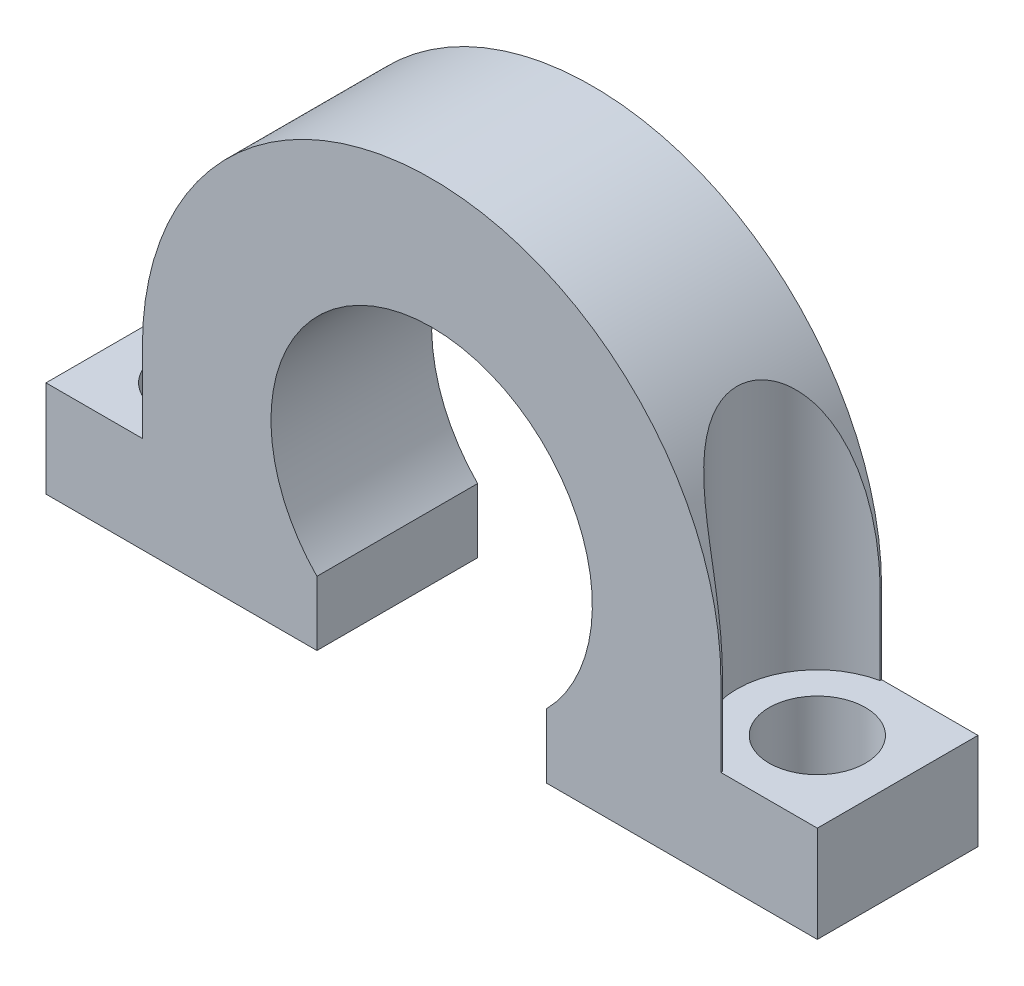
ISO-10303-21;
HEADER;
FILE_DESCRIPTION(('STEP AP214'),'2;1');
FILE_NAME('part.step','',(''),(''),'','','');
FILE_SCHEMA(('AUTOMOTIVE_DESIGN { 1 0 10303 214 1 1 1 1 }'));
ENDSEC;
DATA;
#1=APPLICATION_CONTEXT('core data for automotive mechanical design processes');
#2=APPLICATION_PROTOCOL_DEFINITION('international standard','automotive_design',2000,#1);
#3=PRODUCT_CONTEXT('',#1,'mechanical');
#4=PRODUCT('Part','Part','',(#3));
#5=PRODUCT_RELATED_PRODUCT_CATEGORY('part','',(#4));
#6=PRODUCT_DEFINITION_FORMATION('','',#4);
#7=PRODUCT_DEFINITION_CONTEXT('part definition',#1,'design');
#8=PRODUCT_DEFINITION('design','',#6,#7);
#9=PRODUCT_DEFINITION_SHAPE('','',#8);
#10=(LENGTH_UNIT() NAMED_UNIT(*) SI_UNIT(.MILLI.,.METRE.));
#11=(NAMED_UNIT(*) PLANE_ANGLE_UNIT() SI_UNIT($,.RADIAN.));
#12=(NAMED_UNIT(*) SI_UNIT($,.STERADIAN.) SOLID_ANGLE_UNIT());
#13=UNCERTAINTY_MEASURE_WITH_UNIT(LENGTH_MEASURE(1.E-05),#10,'distance_accuracy_value','');
#14=(GEOMETRIC_REPRESENTATION_CONTEXT(3) GLOBAL_UNCERTAINTY_ASSIGNED_CONTEXT((#13)) GLOBAL_UNIT_ASSIGNED_CONTEXT((#10,
#11,#12)) REPRESENTATION_CONTEXT('',''));
#15=CARTESIAN_POINT('',(0.,0.,0.));
#16=DIRECTION('',(0.,0.,1.));
#17=DIRECTION('',(1.,0.,0.));
#18=AXIS2_PLACEMENT_3D('',#15,#16,#17);
#19=CARTESIAN_POINT('',(9.,0.,5.));
#20=DIRECTION('',(1.,0.,0.));
#21=DIRECTION('',(0.,0.,-1.));
#22=AXIS2_PLACEMENT_3D('',#19,#20,#21);
#23=PLANE('',#22);
#24=DIRECTION('',(0.,0.,-1.));
#25=VECTOR('',#24,1.);
#26=CARTESIAN_POINT('',(9.,0.,5.));
#27=LINE('',#26,#25);
#28=CARTESIAN_POINT('',(9.,0.,0.0505102572168213));
#29=VERTEX_POINT('',#28);
#30=CARTESIAN_POINT('',(9.,0.,0.));
#31=VERTEX_POINT('',#30);
#32=EDGE_CURVE('E151',#29,#31,#27,.T.);
#33=ORIENTED_EDGE('',*,*,#32,.F.);
#34=DIRECTION('',(0.,-1.,0.));
#35=VECTOR('',#34,1.);
#36=CARTESIAN_POINT('',(9.,9.,0.0505102572168213));
#37=LINE('',#36,#35);
#38=CARTESIAN_POINT('',(9.,-2.5,0.0505102572168213));
#39=VERTEX_POINT('',#38);
#40=EDGE_CURVE('E473',#29,#39,#37,.T.);
#41=ORIENTED_EDGE('',*,*,#40,.T.);
#42=DIRECTION('',(0.,0.,-1.));
#43=VECTOR('',#42,1.);
#44=CARTESIAN_POINT('',(9.,-2.5,5.));
#45=LINE('',#44,#43);
#46=CARTESIAN_POINT('',(9.,-2.5,0.));
#47=VERTEX_POINT('',#46);
#48=EDGE_CURVE('E150',#39,#47,#45,.T.);
#49=ORIENTED_EDGE('',*,*,#48,.T.);
#50=DIRECTION('',(0.,-1.,0.));
#51=VECTOR('',#50,1.);
#52=CARTESIAN_POINT('',(9.,0.,0.));
#53=LINE('',#52,#51);
#54=EDGE_CURVE('E195',#31,#47,#53,.T.);
#55=ORIENTED_EDGE('',*,*,#54,.F.);
#56=EDGE_LOOP('',(#33,#41,#49,#55));
#57=FACE_BOUND('',#56,.T.);
#58=ADVANCED_FACE('F32',(#57),#23,.T.);
#59=CARTESIAN_POINT('',(-9.,-2.5,5.));
#60=DIRECTION('',(-1.,0.,0.));
#61=DIRECTION('',(0.,0.,1.));
#62=AXIS2_PLACEMENT_3D('',#59,#60,#61);
#63=PLANE('',#62);
#64=DIRECTION('',(0.,0.,-1.));
#65=VECTOR('',#64,1.);
#66=CARTESIAN_POINT('',(-9.,0.,5.));
#67=LINE('',#66,#65);
#68=CARTESIAN_POINT('',(-9.,0.,5.));
#69=VERTEX_POINT('',#68);
#70=CARTESIAN_POINT('',(-9.,0.,4.94948974278318));
#71=VERTEX_POINT('',#70);
#72=EDGE_CURVE('E163',#69,#71,#67,.T.);
#73=ORIENTED_EDGE('',*,*,#72,.T.);
#74=DIRECTION('',(0.,-1.,0.));
#75=VECTOR('',#74,1.);
#76=CARTESIAN_POINT('',(-9.,9.,4.94948974278318));
#77=LINE('',#76,#75);
#78=CARTESIAN_POINT('',(-9.,-2.5,4.94948974278318));
#79=VERTEX_POINT('',#78);
#80=EDGE_CURVE('E254',#71,#79,#77,.T.);
#81=ORIENTED_EDGE('',*,*,#80,.T.);
#82=DIRECTION('',(0.,0.,-1.));
#83=VECTOR('',#82,1.);
#84=CARTESIAN_POINT('',(-9.,-2.5,5.));
#85=LINE('',#84,#83);
#86=CARTESIAN_POINT('',(-9.,-2.5,5.));
#87=VERTEX_POINT('',#86);
#88=EDGE_CURVE('E49',#87,#79,#85,.T.);
#89=ORIENTED_EDGE('',*,*,#88,.F.);
#90=DIRECTION('',(0.,1.,0.));
#91=VECTOR('',#90,1.);
#92=CARTESIAN_POINT('',(-9.,-2.5,5.));
#93=LINE('',#92,#91);
#94=EDGE_CURVE('E164',#87,#69,#93,.T.);
#95=ORIENTED_EDGE('',*,*,#94,.T.);
#96=EDGE_LOOP('',(#73,#81,#89,#95));
#97=FACE_BOUND('',#96,.T.);
#98=ADVANCED_FACE('F260',(#97),#63,.T.);
#99=CARTESIAN_POINT('',(9.,-2.5,5.));
#100=VERTEX_POINT('',#99);
#101=CARTESIAN_POINT('',(9.,-2.5,4.94948974278318));
#102=VERTEX_POINT('',#101);
#103=EDGE_CURVE('E206',#100,#102,#45,.T.);
#104=ORIENTED_EDGE('',*,*,#103,.T.);
#105=DIRECTION('',(0.,-1.,0.));
#106=VECTOR('',#105,1.);
#107=CARTESIAN_POINT('',(9.,9.,4.94948974278318));
#108=LINE('',#107,#106);
#109=CARTESIAN_POINT('',(9.,0.,4.94948974278318));
#110=VERTEX_POINT('',#109);
#111=EDGE_CURVE('E146',#102,#110,#108,.F.);
#112=ORIENTED_EDGE('',*,*,#111,.T.);
#113=CARTESIAN_POINT('',(9.,0.,5.));
#114=VERTEX_POINT('',#113);
#115=EDGE_CURVE('E139',#114,#110,#27,.T.);
#116=ORIENTED_EDGE('',*,*,#115,.F.);
#117=DIRECTION('',(0.,-1.,0.));
#118=VECTOR('',#117,1.);
#119=CARTESIAN_POINT('',(9.,0.,5.));
#120=LINE('',#119,#118);
#121=EDGE_CURVE('E143',#114,#100,#120,.T.);
#122=ORIENTED_EDGE('',*,*,#121,.T.);
#123=EDGE_LOOP('',(#104,#112,#116,#122));
#124=FACE_BOUND('',#123,.T.);
#125=ADVANCED_FACE('F142',(#124),#23,.T.);
#126=CARTESIAN_POINT('',(0.,0.,5.));
#127=DIRECTION('',(0.,0.,-1.));
#128=DIRECTION('',(-1.,0.,0.));
#129=AXIS2_PLACEMENT_3D('',#126,#127,#128);
#130=CYLINDRICAL_SURFACE('',#129,9.);
#131=CARTESIAN_POINT('',(-9.,0.,0.0505102572168209));
#132=VERTEX_POINT('',#131);
#133=CARTESIAN_POINT('',(-9.,0.,0.));
#134=VERTEX_POINT('',#133);
#135=EDGE_CURVE('E91',#132,#134,#67,.T.);
#136=ORIENTED_EDGE('',*,*,#135,.F.);
#137=CARTESIAN_POINT('',(-9.,0.,0.0505102572168209));
#138=CARTESIAN_POINT('',(-9.00000087562687,0.10518954389977,0.0505192598018908));
#139=CARTESIAN_POINT('',(-8.99815585961762,0.2103788002763,0.0508869358986503));
#140=CARTESIAN_POINT('',(-8.9907805688804,0.420625297368176,0.0524049397413621));
#141=CARTESIAN_POINT('',(-8.98525018974616,0.52568253425893,0.0535552896604704));
#142=CARTESIAN_POINT('',(-8.97050334416002,0.735632272470598,0.056705523598621));
#143=CARTESIAN_POINT('',(-8.96128320507734,0.840524504806676,0.0587062541741343));
#144=CARTESIAN_POINT('',(-8.93917281899488,1.04989188588659,0.0636915639051354));
#145=CARTESIAN_POINT('',(-8.92628260863443,1.1543670387837,0.0666761332387354));
#146=CARTESIAN_POINT('',(-8.88189821371534,1.46862841347652,0.0774172340411788));
#147=CARTESIAN_POINT('',(-8.84480621383425,1.6775962387999,0.0869416097761807));
#148=CARTESIAN_POINT('',(-8.75607223794641,2.09189679975476,0.11280226243128));
#149=CARTESIAN_POINT('',(-8.70443865984531,2.29723156098695,0.129134610285925));
#150=CARTESIAN_POINT('',(-8.60891557883608,2.62759016544451,0.163872489447794));
#151=CARTESIAN_POINT('',(-8.56925256497087,2.75416421119305,0.179264284785005));
#152=CARTESIAN_POINT('',(-8.48460312162089,3.00482929639772,0.215030306512376));
#153=CARTESIAN_POINT('',(-8.43961655268337,3.12892027070917,0.235404663437734));
#154=CARTESIAN_POINT('',(-8.34477051120259,3.37372157523942,0.282290200496294));
#155=CARTESIAN_POINT('',(-8.29492245415785,3.49443900781135,0.30878719514737));
#156=CARTESIAN_POINT('',(-8.19078788033777,3.73199543672591,0.369367426358142));
#157=CARTESIAN_POINT('',(-8.13650280268749,3.84883567346581,0.403448209283725));
#158=CARTESIAN_POINT('',(-8.0409267817847,4.04370431569827,0.46938455082877));
#159=CARTESIAN_POINT('',(-8.00055264337671,4.12297311805137,0.49890635397994));
#160=CARTESIAN_POINT('',(-7.91841144990452,4.27860900679302,0.563173161713274));
#161=CARTESIAN_POINT('',(-7.87664478571677,4.35497689479306,0.597916710019088));
#162=CARTESIAN_POINT('',(-7.79228527909037,4.50417829306891,0.673280118496684));
#163=CARTESIAN_POINT('',(-7.74969339235354,4.57701558543396,0.713893496238789));
#164=CARTESIAN_POINT('',(-7.66437654390341,4.71849128592082,0.801697575439036));
#165=CARTESIAN_POINT('',(-7.62165164650168,4.78713146691606,0.848885471795271));
#166=CARTESIAN_POINT('',(-7.52144632363581,4.94361287731968,0.969150151078017));
#167=CARTESIAN_POINT('',(-7.4642860938569,5.02929169505435,1.04538249314183));
#168=CARTESIAN_POINT('',(-7.35461505487417,5.18834838258779,1.21264513363957));
#169=CARTESIAN_POINT('',(-7.30209816975124,5.26174244310554,1.30365563828947));
#170=CARTESIAN_POINT('',(-7.2153523993646,5.37986792487318,1.48111972038228));
#171=CARTESIAN_POINT('',(-7.17955965092524,5.42739745061617,1.56492934033137));
#172=CARTESIAN_POINT('',(-7.11608756605497,5.51035691872144,1.74123922984381));
#173=CARTESIAN_POINT('',(-7.08840440367026,5.5457925680591,1.83373537397607));
#174=CARTESIAN_POINT('',(-7.0433260406144,5.60293807944634,2.02611031027793));
#175=CARTESIAN_POINT('',(-7.02600752858423,5.62454570663911,2.12603812943071));
#176=CARTESIAN_POINT('',(-7.00373911506158,5.65225388772259,2.32936881008092));
#177=CARTESIAN_POINT('',(-6.99878181455195,5.65836371812565,2.4327695552121));
#178=CARTESIAN_POINT('',(-7.00155445293326,5.65492889108807,2.62650331602725));
#179=CARTESIAN_POINT('',(-7.00781632421854,5.64719574924814,2.71689789680465));
#180=CARTESIAN_POINT('',(-7.02972751609976,5.61989628784571,2.89468109567283));
#181=CARTESIAN_POINT('',(-7.04537587780184,5.60033117699767,2.98207001984781));
#182=CARTESIAN_POINT('',(-7.084816743789,5.55034846782082,3.15149783858141));
#183=CARTESIAN_POINT('',(-7.10859280610232,5.51995277405638,3.23354713913587));
#184=CARTESIAN_POINT('',(-7.16270193033711,5.44955708525262,3.39105944179871));
#185=CARTESIAN_POINT('',(-7.19303792970967,5.40955278671844,3.46651947200145));
#186=CARTESIAN_POINT('',(-7.27293781874538,5.3019408536592,3.64151559300579));
#187=CARTESIAN_POINT('',(-7.32510817548217,5.22991305873915,3.73714582631619));
#188=CARTESIAN_POINT('',(-7.43499020111441,5.0724893768648,3.91299274755286));
#189=CARTESIAN_POINT('',(-7.4927129528506,4.98706652936295,3.99317760669587));
#190=CARTESIAN_POINT('',(-7.5947807010306,4.82966909180307,4.12016365338923));
#191=CARTESIAN_POINT('',(-7.63869695072026,4.75998166821211,4.17022164400622));
#192=CARTESIAN_POINT('',(-7.72655817707644,4.61599480639774,4.26323575589728));
#193=CARTESIAN_POINT('',(-7.77050315719068,4.54169309874862,4.30618834388651));
#194=CARTESIAN_POINT('',(-7.85763291038962,4.3892286384456,4.38576691443791));
#195=CARTESIAN_POINT('',(-7.90081661992494,4.31106098775352,4.42238459236354));
#196=CARTESIAN_POINT('',(-7.98577539744816,4.15157418590454,4.48999201672684));
#197=CARTESIAN_POINT('',(-8.02754993964106,4.07025388221604,4.52097968097597));
#198=CARTESIAN_POINT('',(-8.13733022329687,3.84811928703314,4.59767174470065));
#199=CARTESIAN_POINT('',(-8.20360594090217,3.70487124422167,4.63883043093934));
#200=CARTESIAN_POINT('',(-8.32937280235805,3.41275574503438,4.7101701562913));
#201=CARTESIAN_POINT('',(-8.38885910559575,3.26388437883749,4.74034339632088));
#202=CARTESIAN_POINT('',(-8.50036251105949,2.96140223738335,4.79227335786243));
#203=CARTESIAN_POINT('',(-8.55235472338514,2.8077776378995,4.81400242159528));
#204=CARTESIAN_POINT('',(-8.64813903363084,2.49722137448821,4.8509495910058));
#205=CARTESIAN_POINT('',(-8.69192952400983,2.34028906894084,4.86616642103229));
#206=CARTESIAN_POINT('',(-8.77611054638887,2.00344432704932,4.89336389718386));
#207=CARTESIAN_POINT('',(-8.81532880804,1.82318488248432,4.90467143695235));
#208=CARTESIAN_POINT('',(-8.88264628677153,1.46036160720787,4.92282596299743));
#209=CARTESIAN_POINT('',(-8.9107432454381,1.27779731620815,4.92967204346341));
#210=CARTESIAN_POINT('',(-8.9554388182679,0.912988359853412,4.94007711850932));
#211=CARTESIAN_POINT('',(-8.97214774262027,0.730758192501817,4.94366776258925));
#212=CARTESIAN_POINT('',(-8.98885772942567,0.456945872457939,4.94719446151849));
#213=CARTESIAN_POINT('',(-8.99303549117236,0.365611480468681,4.94806015980659));
#214=CARTESIAN_POINT('',(-8.99860663114833,0.182853415689014,4.94920585201511));
#215=CARTESIAN_POINT('',(-8.99999998825157,0.0914297422264674,4.94948584149158));
#216=CARTESIAN_POINT('',(-9.,0.,4.94948974278323));
#217=B_SPLINE_CURVE_WITH_KNOTS('',3,(#137,#138,#139,#140,#141,#142,#143,#144,#145,#146,#147,
#148,#149,#150,#151,#152,#153,#154,#155,#156,#157,#158,#159,#160,#161,#162,#163,#164,#165,#166,
#167,#168,#169,#170,#171,#172,#173,#174,#175,#176,#177,#178,#179,#180,#181,#182,#183,#184,#185,
#186,#187,#188,#189,#190,#191,#192,#193,#194,#195,#196,#197,#198,#199,#200,#201,#202,#203,#204,
#205,#206,#207,#208,#209,#210,#211,#212,#213,#214,#215,#216),.UNSPECIFIED.,.F.,.F.,(4,2,2,2,2,2,
2,2,2,2,2,2,2,2,2,2,2,2,2,2,2,2,2,2,2,2,2,2,2,2,2,2,2,2,2,2,2,2,2,4),(0.,0.31555109411797,
0.63111112817335,0.946986041677593,1.26285780182566,1.89956471671294,2.53590467841028,
2.93631571568562,3.33673724421808,3.73624018063852,4.13561405062598,4.41663096127427,
4.6975696449165,4.97820040761455,5.25871180022386,5.64184725770908,6.02447371576498,
6.33160496056692,6.63859107226289,6.94782137762819,7.25686654336132,7.52836947879261,
7.79984468307422,8.07077392369024,8.34182473490995,8.73143192344412,9.12183359448996,
9.41061585324703,9.69954128511489,9.98884265479976,10.278250802061,10.7668028672774,
11.2557011052846,11.7461874331695,12.2367697962119,12.7908026103572,13.3449478748351,
13.8936460715452,14.1679099625106,14.4421759343852),.UNSPECIFIED.);
#218=EDGE_CURVE('E253',#132,#71,#217,.T.);
#219=ORIENTED_EDGE('',*,*,#218,.T.);
#220=ORIENTED_EDGE('',*,*,#72,.F.);
#221=CARTESIAN_POINT('',(0.,0.,5.));
#222=DIRECTION('',(0.,0.,-1.));
#223=DIRECTION('',(-1.,0.,0.));
#224=AXIS2_PLACEMENT_3D('',#221,#222,#223);
#225=CIRCLE('',#224,9.);
#226=EDGE_CURVE('E155',#69,#114,#225,.T.);
#227=ORIENTED_EDGE('',*,*,#226,.T.);
#228=ORIENTED_EDGE('',*,*,#115,.T.);
#229=CARTESIAN_POINT('',(9.,0.,4.94948974278318));
#230=CARTESIAN_POINT('',(9.00000087562687,0.105189543899771,4.94948074019811));
#231=CARTESIAN_POINT('',(8.99815585961762,0.210378800276302,4.94911306410135));
#232=CARTESIAN_POINT('',(8.9907805688804,0.420625297368177,4.94759506025864));
#233=CARTESIAN_POINT('',(8.98525018974616,0.525682534258931,4.94644471033953));
#234=CARTESIAN_POINT('',(8.97050334416002,0.735632272470599,4.94329447640138));
#235=CARTESIAN_POINT('',(8.96128320507734,0.840524504806677,4.94129374582587));
#236=CARTESIAN_POINT('',(8.93917281899488,1.0498918858866,4.93630843609486));
#237=CARTESIAN_POINT('',(8.92628260863443,1.1543670387837,4.93332386676126));
#238=CARTESIAN_POINT('',(8.88189821371534,1.46862841347652,4.92258276595882));
#239=CARTESIAN_POINT('',(8.84480621383425,1.6775962387999,4.91305839022382));
#240=CARTESIAN_POINT('',(8.75607223794642,2.09189679975476,4.88719773756872));
#241=CARTESIAN_POINT('',(8.70443865984531,2.29723156098695,4.87086538971407));
#242=CARTESIAN_POINT('',(8.60891557883608,2.62759016544451,4.83612751055221));
#243=CARTESIAN_POINT('',(8.56925256497087,2.75416421119305,4.82073571521499));
#244=CARTESIAN_POINT('',(8.48460312162089,3.00482929639772,4.78496969348762));
#245=CARTESIAN_POINT('',(8.43961655268337,3.12892027070917,4.76459533656227));
#246=CARTESIAN_POINT('',(8.34477051120259,3.37372157523942,4.71770979950371));
#247=CARTESIAN_POINT('',(8.29492245415785,3.49443900781135,4.69121280485263));
#248=CARTESIAN_POINT('',(8.19078788033777,3.73199543672591,4.63063257364186));
#249=CARTESIAN_POINT('',(8.13650280268749,3.84883567346581,4.59655179071628));
#250=CARTESIAN_POINT('',(8.04092678178471,4.04370431569826,4.53061544917123));
#251=CARTESIAN_POINT('',(8.00055264337671,4.12297311805137,4.50109364602006));
#252=CARTESIAN_POINT('',(7.91841144990452,4.27860900679302,4.43682683828673));
#253=CARTESIAN_POINT('',(7.87664478571678,4.35497689479305,4.40208328998091));
#254=CARTESIAN_POINT('',(7.79228527909037,4.50417829306891,4.32671988150332));
#255=CARTESIAN_POINT('',(7.74969339235354,4.57701558543396,4.28610650376121));
#256=CARTESIAN_POINT('',(7.66437654390341,4.71849128592082,4.19830242456097));
#257=CARTESIAN_POINT('',(7.62165164650168,4.78713146691605,4.15111452820473));
#258=CARTESIAN_POINT('',(7.52144632363581,4.94361287731968,4.03084984892198));
#259=CARTESIAN_POINT('',(7.46428609385691,5.02929169505434,3.95461750685817));
#260=CARTESIAN_POINT('',(7.35461505487417,5.18834838258779,3.78735486636044));
#261=CARTESIAN_POINT('',(7.30209816975124,5.26174244310553,3.69634436171053));
#262=CARTESIAN_POINT('',(7.2153523993646,5.37986792487317,3.51888027961772));
#263=CARTESIAN_POINT('',(7.17955965092524,5.42739745061617,3.43507065966863));
#264=CARTESIAN_POINT('',(7.11608756605497,5.51035691872143,3.25876077015619));
#265=CARTESIAN_POINT('',(7.08840440367026,5.54579256805909,3.16626462602393));
#266=CARTESIAN_POINT('',(7.0433260406144,5.60293807944633,2.97388968972207));
#267=CARTESIAN_POINT('',(7.02600752858423,5.62454570663911,2.87396187056928));
#268=CARTESIAN_POINT('',(7.00373911506158,5.65225388772259,2.67063118991908));
#269=CARTESIAN_POINT('',(6.99878181455196,5.65836371812565,2.5672304447879));
#270=CARTESIAN_POINT('',(7.00155445293326,5.65492889108806,2.37349668397275));
#271=CARTESIAN_POINT('',(7.00781632421854,5.64719574924814,2.28310210319535));
#272=CARTESIAN_POINT('',(7.02972751609976,5.61989628784571,2.10531890432717));
#273=CARTESIAN_POINT('',(7.04537587780184,5.60033117699767,2.01792998015219));
#274=CARTESIAN_POINT('',(7.084816743789,5.55034846782081,1.84850216141859));
#275=CARTESIAN_POINT('',(7.10859280610232,5.51995277405638,1.76645286086413));
#276=CARTESIAN_POINT('',(7.16270193033711,5.44955708525262,1.60894055820129));
#277=CARTESIAN_POINT('',(7.19303792970967,5.40955278671843,1.53348052799855));
#278=CARTESIAN_POINT('',(7.27293781874538,5.3019408536592,1.35848440699421));
#279=CARTESIAN_POINT('',(7.32510817548217,5.22991305873915,1.2628541736838));
#280=CARTESIAN_POINT('',(7.43499020111441,5.0724893768648,1.08700725244714));
#281=CARTESIAN_POINT('',(7.4927129528506,4.98706652936295,1.00682239330413));
#282=CARTESIAN_POINT('',(7.5947807010306,4.82966909180307,0.87983634661077));
#283=CARTESIAN_POINT('',(7.63869695072026,4.75998166821211,0.829778355993781));
#284=CARTESIAN_POINT('',(7.72655817707644,4.61599480639773,0.736764244102721));
#285=CARTESIAN_POINT('',(7.77050315719068,4.54169309874862,0.693811656113488));
#286=CARTESIAN_POINT('',(7.85763291038962,4.3892286384456,0.614233085562094));
#287=CARTESIAN_POINT('',(7.90081661992494,4.31106098775351,0.577615407636458));
#288=CARTESIAN_POINT('',(7.98577539744816,4.15157418590453,0.510007983273156));
#289=CARTESIAN_POINT('',(8.02754993964107,4.07025388221604,0.479020319024033));
#290=CARTESIAN_POINT('',(8.13733022329688,3.84811928703314,0.402328255299355));
#291=CARTESIAN_POINT('',(8.20360594090217,3.70487124422167,0.361169569060658));
#292=CARTESIAN_POINT('',(8.32937280235805,3.41275574503437,0.289829843708695));
#293=CARTESIAN_POINT('',(8.38885910559575,3.26388437883748,0.25965660367912));
#294=CARTESIAN_POINT('',(8.50036251105949,2.96140223738335,0.207726642137574));
#295=CARTESIAN_POINT('',(8.55235472338514,2.8077776378995,0.18599757840472));
#296=CARTESIAN_POINT('',(8.64813903363084,2.49722137448821,0.149050408994201));
#297=CARTESIAN_POINT('',(8.69192952400983,2.34028906894083,0.13383357896771));
#298=CARTESIAN_POINT('',(8.77611054638887,2.00344432704931,0.106636102816137));
#299=CARTESIAN_POINT('',(8.81532880804,1.82318488248431,0.0953285630476531));
#300=CARTESIAN_POINT('',(8.88264628677153,1.46036160720787,0.0771740370025733));
#301=CARTESIAN_POINT('',(8.9107432454381,1.27779731620815,0.0703279565365908));
#302=CARTESIAN_POINT('',(8.9554388182679,0.912988359853412,0.0599228814906764));
#303=CARTESIAN_POINT('',(8.97214774262027,0.730758192501817,0.0563322374107528));
#304=CARTESIAN_POINT('',(8.98885772942567,0.45694587245794,0.0528055384815075));
#305=CARTESIAN_POINT('',(8.99303549117236,0.365611480468682,0.0519398401934063));
#306=CARTESIAN_POINT('',(8.99860663114833,0.182853415689016,0.0507941479848946));
#307=CARTESIAN_POINT('',(8.99999998825157,0.0914297422264693,0.0505141585084207));
#308=CARTESIAN_POINT('',(9.,0.,0.0505102572167737));
#309=B_SPLINE_CURVE_WITH_KNOTS('',3,(#229,#230,#231,#232,#233,#234,#235,#236,#237,#238,#239,
#240,#241,#242,#243,#244,#245,#246,#247,#248,#249,#250,#251,#252,#253,#254,#255,#256,#257,#258,
#259,#260,#261,#262,#263,#264,#265,#266,#267,#268,#269,#270,#271,#272,#273,#274,#275,#276,#277,
#278,#279,#280,#281,#282,#283,#284,#285,#286,#287,#288,#289,#290,#291,#292,#293,#294,#295,#296,
#297,#298,#299,#300,#301,#302,#303,#304,#305,#306,#307,#308),.UNSPECIFIED.,.F.,.F.,(4,2,2,2,2,2,
2,2,2,2,2,2,2,2,2,2,2,2,2,2,2,2,2,2,2,2,2,2,2,2,2,2,2,2,2,2,2,2,2,4),(0.,0.31555109411797,
0.63111112817335,0.946986041677593,1.26285780182566,1.89956471671294,2.53590467841028,
2.93631571568562,3.33673724421807,3.73624018063852,4.13561405062597,4.41663096127427,
4.69756964491649,4.97820040761455,5.25871180022385,5.64184725770907,6.02447371576497,
6.33160496056692,6.63859107226289,6.94782137762819,7.25686654336132,7.52836947879261,
7.79984468307422,8.07077392369024,8.34182473490995,8.73143192344412,9.12183359448996,
9.41061585324703,9.69954128511489,9.98884265479975,10.278250802061,10.7668028672774,
11.2557011052846,11.7461874331694,12.2367697962119,12.7908026103572,13.3449478748351,
13.8936460715452,14.1679099625106,14.4421759343852),.UNSPECIFIED.);
#310=EDGE_CURVE('E291',#110,#29,#309,.T.);
#311=ORIENTED_EDGE('',*,*,#310,.T.);
#312=ORIENTED_EDGE('',*,*,#32,.T.);
#313=CARTESIAN_POINT('',(0.,0.,0.));
#314=DIRECTION('',(0.,0.,-1.));
#315=DIRECTION('',(-1.,0.,0.));
#316=AXIS2_PLACEMENT_3D('',#313,#314,#315);
#317=CIRCLE('',#316,9.);
#318=EDGE_CURVE('E198',#134,#31,#317,.T.);
#319=ORIENTED_EDGE('',*,*,#318,.F.);
#320=EDGE_LOOP('',(#136,#219,#220,#227,#228,#311,#312,#319));
#321=FACE_BOUND('',#320,.T.);
#322=ADVANCED_FACE('F160',(#321),#130,.T.);
#323=CARTESIAN_POINT('',(-9.,-2.5,0.0505102572168209));
#324=VERTEX_POINT('',#323);
#325=CARTESIAN_POINT('',(-9.,-2.5,0.));
#326=VERTEX_POINT('',#325);
#327=EDGE_CURVE('E99',#324,#326,#85,.T.);
#328=ORIENTED_EDGE('',*,*,#327,.F.);
#329=DIRECTION('',(0.,-1.,0.));
#330=VECTOR('',#329,1.);
#331=CARTESIAN_POINT('',(-9.,9.,0.0505102572168209));
#332=LINE('',#331,#330);
#333=EDGE_CURVE('E238',#324,#132,#332,.F.);
#334=ORIENTED_EDGE('',*,*,#333,.T.);
#335=ORIENTED_EDGE('',*,*,#135,.T.);
#336=DIRECTION('',(0.,1.,0.));
#337=VECTOR('',#336,1.);
#338=CARTESIAN_POINT('',(-9.,-2.5,0.));
#339=LINE('',#338,#337);
#340=EDGE_CURVE('E201',#326,#134,#339,.T.);
#341=ORIENTED_EDGE('',*,*,#340,.F.);
#342=EDGE_LOOP('',(#328,#334,#335,#341));
#343=FACE_BOUND('',#342,.T.);
#344=ADVANCED_FACE('F234',(#343),#63,.T.);
#345=CARTESIAN_POINT('',(-9.5,-5.5,2.5));
#346=DIRECTION('',(0.,1.,0.));
#347=DIRECTION('',(0.,0.,1.));
#348=AXIS2_PLACEMENT_3D('',#345,#346,#347);
#349=CYLINDRICAL_SURFACE('',#348,1.5);
#350=CARTESIAN_POINT('',(-9.5,-5.5,2.5));
#351=DIRECTION('',(0.,1.,0.));
#352=DIRECTION('',(0.,0.,1.));
#353=AXIS2_PLACEMENT_3D('',#350,#351,#352);
#354=CIRCLE('',#353,1.5);
#355=CARTESIAN_POINT('',(-9.5,-5.5,4.));
#356=VERTEX_POINT('',#355);
#357=EDGE_CURVE('E502',#356,#356,#354,.T.);
#358=ORIENTED_EDGE('',*,*,#357,.F.);
#359=EDGE_LOOP('',(#358));
#360=FACE_BOUND('',#359,.T.);
#361=CARTESIAN_POINT('',(-9.5,-2.5,2.5));
#362=DIRECTION('',(0.,-1.,0.));
#363=DIRECTION('',(0.,0.,-1.));
#364=AXIS2_PLACEMENT_3D('',#361,#362,#363);
#365=CIRCLE('',#364,1.5);
#366=CARTESIAN_POINT('',(-9.5,-2.5,1.));
#367=VERTEX_POINT('',#366);
#368=EDGE_CURVE('E172',#367,#367,#365,.T.);
#369=ORIENTED_EDGE('',*,*,#368,.F.);
#370=EDGE_LOOP('',(#369));
#371=FACE_BOUND('',#370,.T.);
#372=ADVANCED_FACE('F272',(#360,#371),#349,.F.);
#373=CARTESIAN_POINT('',(9.5,-5.5,2.5));
#374=DIRECTION('',(0.,1.,0.));
#375=DIRECTION('',(0.,0.,1.));
#376=AXIS2_PLACEMENT_3D('',#373,#374,#375);
#377=CYLINDRICAL_SURFACE('',#376,1.5);
#378=CARTESIAN_POINT('',(9.5,-5.5,2.5));
#379=DIRECTION('',(0.,1.,0.));
#380=DIRECTION('',(0.,0.,1.));
#381=AXIS2_PLACEMENT_3D('',#378,#379,#380);
#382=CIRCLE('',#381,1.5);
#383=CARTESIAN_POINT('',(9.5,-5.5,4.));
#384=VERTEX_POINT('',#383);
#385=EDGE_CURVE('E257',#384,#384,#382,.T.);
#386=ORIENTED_EDGE('',*,*,#385,.F.);
#387=EDGE_LOOP('',(#386));
#388=FACE_BOUND('',#387,.T.);
#389=CARTESIAN_POINT('',(9.5,-2.5,2.5));
#390=DIRECTION('',(0.,-1.,0.));
#391=DIRECTION('',(0.,0.,-1.));
#392=AXIS2_PLACEMENT_3D('',#389,#390,#391);
#393=CIRCLE('',#392,1.5);
#394=CARTESIAN_POINT('',(9.5,-2.5,0.999999999999999));
#395=VERTEX_POINT('',#394);
#396=EDGE_CURVE('E505',#395,#395,#393,.T.);
#397=ORIENTED_EDGE('',*,*,#396,.F.);
#398=EDGE_LOOP('',(#397));
#399=FACE_BOUND('',#398,.T.);
#400=ADVANCED_FACE('F277',(#388,#399),#377,.F.);
#401=CARTESIAN_POINT('',(-9.,-2.5,5.));
#402=DIRECTION('',(0.,-1.,0.));
#403=DIRECTION('',(0.,0.,-1.));
#404=AXIS2_PLACEMENT_3D('',#401,#402,#403);
#405=PLANE('',#404);
#406=ORIENTED_EDGE('',*,*,#368,.T.);
#407=EDGE_LOOP('',(#406));
#408=FACE_BOUND('',#407,.T.);
#409=DIRECTION('',(-1.,0.,0.));
#410=VECTOR('',#409,1.);
#411=CARTESIAN_POINT('',(-9.,-2.5,0.));
#412=LINE('',#411,#410);
#413=CARTESIAN_POINT('',(-12.,-2.5,0.));
#414=VERTEX_POINT('',#413);
#415=EDGE_CURVE('E169',#326,#414,#412,.T.);
#416=ORIENTED_EDGE('',*,*,#415,.T.);
#417=DIRECTION('',(0.,0.,-1.));
#418=VECTOR('',#417,1.);
#419=CARTESIAN_POINT('',(-12.,-2.5,5.));
#420=LINE('',#419,#418);
#421=CARTESIAN_POINT('',(-12.,-2.5,5.));
#422=VERTEX_POINT('',#421);
#423=EDGE_CURVE('E11',#422,#414,#420,.T.);
#424=ORIENTED_EDGE('',*,*,#423,.F.);
#425=DIRECTION('',(-1.,0.,0.));
#426=VECTOR('',#425,1.);
#427=CARTESIAN_POINT('',(-9.,-2.5,5.));
#428=LINE('',#427,#426);
#429=EDGE_CURVE('E107',#87,#422,#428,.T.);
#430=ORIENTED_EDGE('',*,*,#429,.F.);
#431=ORIENTED_EDGE('',*,*,#88,.T.);
#432=CARTESIAN_POINT('',(-9.5,-2.5,2.5));
#433=DIRECTION('',(0.,1.,0.));
#434=DIRECTION('',(0.,0.,1.));
#435=AXIS2_PLACEMENT_3D('',#432,#433,#434);
#436=CIRCLE('',#435,2.5);
#437=EDGE_CURVE('E256',#79,#324,#436,.T.);
#438=ORIENTED_EDGE('',*,*,#437,.T.);
#439=ORIENTED_EDGE('',*,*,#327,.T.);
#440=EDGE_LOOP('',(#416,#424,#430,#431,#438,#439));
#441=FACE_BOUND('',#440,.T.);
#442=ADVANCED_FACE('F34',(#408,#441),#405,.F.);
#443=CARTESIAN_POINT('',(-12.,-5.5,5.));
#444=DIRECTION('',(-1.,0.,0.));
#445=DIRECTION('',(0.,0.,1.));
#446=AXIS2_PLACEMENT_3D('',#443,#444,#445);
#447=PLANE('',#446);
#448=DIRECTION('',(0.,1.,0.));
#449=VECTOR('',#448,1.);
#450=CARTESIAN_POINT('',(-12.,-5.5,0.));
#451=LINE('',#450,#449);
#452=CARTESIAN_POINT('',(-12.,-5.5,0.));
#453=VERTEX_POINT('',#452);
#454=EDGE_CURVE('E171',#453,#414,#451,.T.);
#455=ORIENTED_EDGE('',*,*,#454,.F.);
#456=DIRECTION('',(0.,0.,-1.));
#457=VECTOR('',#456,1.);
#458=CARTESIAN_POINT('',(-12.,-5.5,5.));
#459=LINE('',#458,#457);
#460=CARTESIAN_POINT('',(-12.,-5.5,5.));
#461=VERTEX_POINT('',#460);
#462=EDGE_CURVE('E41',#461,#453,#459,.T.);
#463=ORIENTED_EDGE('',*,*,#462,.F.);
#464=DIRECTION('',(0.,1.,0.));
#465=VECTOR('',#464,1.);
#466=CARTESIAN_POINT('',(-12.,-5.5,5.));
#467=LINE('',#466,#465);
#468=EDGE_CURVE('E233',#461,#422,#467,.T.);
#469=ORIENTED_EDGE('',*,*,#468,.T.);
#470=ORIENTED_EDGE('',*,*,#423,.T.);
#471=EDGE_LOOP('',(#455,#463,#469,#470));
#472=FACE_BOUND('',#471,.T.);
#473=ADVANCED_FACE('F232',(#472),#447,.T.);
#474=CARTESIAN_POINT('',(-12.,-5.5,5.));
#475=DIRECTION('',(0.,1.,0.));
#476=DIRECTION('',(0.,0.,1.));
#477=AXIS2_PLACEMENT_3D('',#474,#475,#476);
#478=PLANE('',#477);
#479=ORIENTED_EDGE('',*,*,#357,.T.);
#480=EDGE_LOOP('',(#479));
#481=FACE_BOUND('',#480,.T.);
#482=DIRECTION('',(1.,0.,0.));
#483=VECTOR('',#482,1.);
#484=CARTESIAN_POINT('',(-12.,-5.5,0.));
#485=LINE('',#484,#483);
#486=CARTESIAN_POINT('',(-3.57071421427143,-5.5,0.));
#487=VERTEX_POINT('',#486);
#488=EDGE_CURVE('E175',#453,#487,#485,.T.);
#489=ORIENTED_EDGE('',*,*,#488,.T.);
#490=DIRECTION('',(0.,0.,-1.));
#491=VECTOR('',#490,1.);
#492=CARTESIAN_POINT('',(-3.57071421427143,-5.5,5.));
#493=LINE('',#492,#491);
#494=CARTESIAN_POINT('',(-3.57071421427143,-5.5,5.));
#495=VERTEX_POINT('',#494);
#496=EDGE_CURVE('E218',#495,#487,#493,.T.);
#497=ORIENTED_EDGE('',*,*,#496,.F.);
#498=DIRECTION('',(1.,0.,0.));
#499=VECTOR('',#498,1.);
#500=CARTESIAN_POINT('',(-12.,-5.5,5.));
#501=LINE('',#500,#499);
#502=EDGE_CURVE('E224',#461,#495,#501,.T.);
#503=ORIENTED_EDGE('',*,*,#502,.F.);
#504=ORIENTED_EDGE('',*,*,#462,.T.);
#505=EDGE_LOOP('',(#489,#497,#503,#504));
#506=FACE_BOUND('',#505,.T.);
#507=ADVANCED_FACE('F222',(#481,#506),#478,.F.);
#508=CARTESIAN_POINT('',(-3.57071421427143,-3.5,5.));
#509=DIRECTION('',(1.,0.,0.));
#510=DIRECTION('',(0.,0.,-1.));
#511=AXIS2_PLACEMENT_3D('',#508,#509,#510);
#512=PLANE('',#511);
#513=DIRECTION('',(0.,-1.,0.));
#514=VECTOR('',#513,1.);
#515=CARTESIAN_POINT('',(-3.57071421427143,-3.5,0.));
#516=LINE('',#515,#514);
#517=CARTESIAN_POINT('',(-3.57071421427143,-3.5,0.));
#518=VERTEX_POINT('',#517);
#519=EDGE_CURVE('E178',#518,#487,#516,.T.);
#520=ORIENTED_EDGE('',*,*,#519,.F.);
#521=DIRECTION('',(0.,0.,-1.));
#522=VECTOR('',#521,1.);
#523=CARTESIAN_POINT('',(-3.57071421427143,-3.5,5.));
#524=LINE('',#523,#522);
#525=CARTESIAN_POINT('',(-3.57071421427143,-3.5,5.));
#526=VERTEX_POINT('',#525);
#527=EDGE_CURVE('E216',#526,#518,#524,.T.);
#528=ORIENTED_EDGE('',*,*,#527,.F.);
#529=DIRECTION('',(0.,-1.,0.));
#530=VECTOR('',#529,1.);
#531=CARTESIAN_POINT('',(-3.57071421427143,-3.5,5.));
#532=LINE('',#531,#530);
#533=EDGE_CURVE('E482',#526,#495,#532,.T.);
#534=ORIENTED_EDGE('',*,*,#533,.T.);
#535=ORIENTED_EDGE('',*,*,#496,.T.);
#536=EDGE_LOOP('',(#520,#528,#534,#535));
#537=FACE_BOUND('',#536,.T.);
#538=ADVANCED_FACE('F406',(#537),#512,.T.);
#539=CARTESIAN_POINT('',(0.,0.,5.));
#540=DIRECTION('',(0.,0.,-1.));
#541=DIRECTION('',(-1.,0.,0.));
#542=AXIS2_PLACEMENT_3D('',#539,#540,#541);
#543=CYLINDRICAL_SURFACE('',#542,5.);
#544=CARTESIAN_POINT('',(0.,0.,0.));
#545=DIRECTION('',(0.,0.,-1.));
#546=DIRECTION('',(-1.,0.,0.));
#547=AXIS2_PLACEMENT_3D('',#544,#545,#546);
#548=CIRCLE('',#547,5.);
#549=CARTESIAN_POINT('',(3.57071421427143,-3.5,0.));
#550=VERTEX_POINT('',#549);
#551=EDGE_CURVE('E181',#518,#550,#548,.T.);
#552=ORIENTED_EDGE('',*,*,#551,.T.);
#553=DIRECTION('',(0.,0.,-1.));
#554=VECTOR('',#553,1.);
#555=CARTESIAN_POINT('',(3.57071421427143,-3.5,5.));
#556=LINE('',#555,#554);
#557=CARTESIAN_POINT('',(3.57071421427143,-3.5,5.));
#558=VERTEX_POINT('',#557);
#559=EDGE_CURVE('E214',#558,#550,#556,.T.);
#560=ORIENTED_EDGE('',*,*,#559,.F.);
#561=CARTESIAN_POINT('',(0.,0.,5.));
#562=DIRECTION('',(0.,0.,-1.));
#563=DIRECTION('',(-1.,0.,0.));
#564=AXIS2_PLACEMENT_3D('',#561,#562,#563);
#565=CIRCLE('',#564,5.);
#566=EDGE_CURVE('E485',#526,#558,#565,.T.);
#567=ORIENTED_EDGE('',*,*,#566,.F.);
#568=ORIENTED_EDGE('',*,*,#527,.T.);
#569=EDGE_LOOP('',(#552,#560,#567,#568));
#570=FACE_BOUND('',#569,.T.);
#571=ADVANCED_FACE('F415',(#570),#543,.F.);
#572=CARTESIAN_POINT('',(3.57071421427143,-5.5,5.));
#573=DIRECTION('',(-1.,0.,0.));
#574=DIRECTION('',(0.,0.,1.));
#575=AXIS2_PLACEMENT_3D('',#572,#573,#574);
#576=PLANE('',#575);
#577=DIRECTION('',(0.,1.,0.));
#578=VECTOR('',#577,1.);
#579=CARTESIAN_POINT('',(3.57071421427143,-5.5,0.));
#580=LINE('',#579,#578);
#581=CARTESIAN_POINT('',(3.57071421427143,-5.5,0.));
#582=VERTEX_POINT('',#581);
#583=EDGE_CURVE('E184',#582,#550,#580,.T.);
#584=ORIENTED_EDGE('',*,*,#583,.F.);
#585=DIRECTION('',(0.,0.,-1.));
#586=VECTOR('',#585,1.);
#587=CARTESIAN_POINT('',(3.57071421427143,-5.5,5.));
#588=LINE('',#587,#586);
#589=CARTESIAN_POINT('',(3.57071421427143,-5.5,5.));
#590=VERTEX_POINT('',#589);
#591=EDGE_CURVE('E212',#590,#582,#588,.T.);
#592=ORIENTED_EDGE('',*,*,#591,.F.);
#593=DIRECTION('',(0.,1.,0.));
#594=VECTOR('',#593,1.);
#595=CARTESIAN_POINT('',(3.57071421427143,-5.5,5.));
#596=LINE('',#595,#594);
#597=EDGE_CURVE('E487',#590,#558,#596,.T.);
#598=ORIENTED_EDGE('',*,*,#597,.T.);
#599=ORIENTED_EDGE('',*,*,#559,.T.);
#600=EDGE_LOOP('',(#584,#592,#598,#599));
#601=FACE_BOUND('',#600,.T.);
#602=ADVANCED_FACE('F423',(#601),#576,.T.);
#603=CARTESIAN_POINT('',(12.,-5.5,5.));
#604=DIRECTION('',(0.,-1.,0.));
#605=DIRECTION('',(0.,0.,-1.));
#606=AXIS2_PLACEMENT_3D('',#603,#604,#605);
#607=PLANE('',#606);
#608=ORIENTED_EDGE('',*,*,#385,.T.);
#609=EDGE_LOOP('',(#608));
#610=FACE_BOUND('',#609,.T.);
#611=DIRECTION('',(-1.,0.,0.));
#612=VECTOR('',#611,1.);
#613=CARTESIAN_POINT('',(12.,-5.5,0.));
#614=LINE('',#613,#612);
#615=CARTESIAN_POINT('',(12.,-5.5,0.));
#616=VERTEX_POINT('',#615);
#617=EDGE_CURVE('E187',#616,#582,#614,.T.);
#618=ORIENTED_EDGE('',*,*,#617,.F.);
#619=DIRECTION('',(0.,0.,-1.));
#620=VECTOR('',#619,1.);
#621=CARTESIAN_POINT('',(12.,-5.5,5.));
#622=LINE('',#621,#620);
#623=CARTESIAN_POINT('',(12.,-5.5,5.));
#624=VERTEX_POINT('',#623);
#625=EDGE_CURVE('E210',#624,#616,#622,.T.);
#626=ORIENTED_EDGE('',*,*,#625,.F.);
#627=DIRECTION('',(-1.,0.,0.));
#628=VECTOR('',#627,1.);
#629=CARTESIAN_POINT('',(12.,-5.5,5.));
#630=LINE('',#629,#628);
#631=EDGE_CURVE('E490',#624,#590,#630,.T.);
#632=ORIENTED_EDGE('',*,*,#631,.T.);
#633=ORIENTED_EDGE('',*,*,#591,.T.);
#634=EDGE_LOOP('',(#618,#626,#632,#633));
#635=FACE_BOUND('',#634,.T.);
#636=ADVANCED_FACE('F430',(#610,#635),#607,.T.);
#637=CARTESIAN_POINT('',(12.,-5.5,5.));
#638=DIRECTION('',(-1.,0.,0.));
#639=DIRECTION('',(0.,0.,1.));
#640=AXIS2_PLACEMENT_3D('',#637,#638,#639);
#641=PLANE('',#640);
#642=DIRECTION('',(0.,1.,0.));
#643=VECTOR('',#642,1.);
#644=CARTESIAN_POINT('',(12.,-5.5,0.));
#645=LINE('',#644,#643);
#646=CARTESIAN_POINT('',(12.,-2.5,0.));
#647=VERTEX_POINT('',#646);
#648=EDGE_CURVE('E190',#616,#647,#645,.T.);
#649=ORIENTED_EDGE('',*,*,#648,.T.);
#650=DIRECTION('',(0.,0.,-1.));
#651=VECTOR('',#650,1.);
#652=CARTESIAN_POINT('',(12.,-2.5,5.));
#653=LINE('',#652,#651);
#654=CARTESIAN_POINT('',(12.,-2.5,5.));
#655=VERTEX_POINT('',#654);
#656=EDGE_CURVE('E208',#655,#647,#653,.T.);
#657=ORIENTED_EDGE('',*,*,#656,.F.);
#658=DIRECTION('',(0.,1.,0.));
#659=VECTOR('',#658,1.);
#660=CARTESIAN_POINT('',(12.,-5.5,5.));
#661=LINE('',#660,#659);
#662=EDGE_CURVE('E493',#624,#655,#661,.T.);
#663=ORIENTED_EDGE('',*,*,#662,.F.);
#664=ORIENTED_EDGE('',*,*,#625,.T.);
#665=EDGE_LOOP('',(#649,#657,#663,#664));
#666=FACE_BOUND('',#665,.T.);
#667=ADVANCED_FACE('F339',(#666),#641,.F.);
#668=CARTESIAN_POINT('',(12.,-2.5,5.));
#669=DIRECTION('',(0.,-1.,0.));
#670=DIRECTION('',(0.,0.,-1.));
#671=AXIS2_PLACEMENT_3D('',#668,#669,#670);
#672=PLANE('',#671);
#673=ORIENTED_EDGE('',*,*,#48,.F.);
#674=CARTESIAN_POINT('',(9.5,-2.5,2.5));
#675=DIRECTION('',(0.,1.,0.));
#676=DIRECTION('',(0.,0.,1.));
#677=AXIS2_PLACEMENT_3D('',#674,#675,#676);
#678=CIRCLE('',#677,2.5);
#679=EDGE_CURVE('E298',#39,#102,#678,.T.);
#680=ORIENTED_EDGE('',*,*,#679,.T.);
#681=ORIENTED_EDGE('',*,*,#103,.F.);
#682=DIRECTION('',(-1.,0.,0.));
#683=VECTOR('',#682,1.);
#684=CARTESIAN_POINT('',(12.,-2.5,5.));
#685=LINE('',#684,#683);
#686=EDGE_CURVE('E157',#655,#100,#685,.T.);
#687=ORIENTED_EDGE('',*,*,#686,.F.);
#688=ORIENTED_EDGE('',*,*,#656,.T.);
#689=DIRECTION('',(-1.,0.,0.));
#690=VECTOR('',#689,1.);
#691=CARTESIAN_POINT('',(12.,-2.5,0.));
#692=LINE('',#691,#690);
#693=EDGE_CURVE('E193',#647,#47,#692,.T.);
#694=ORIENTED_EDGE('',*,*,#693,.T.);
#695=EDGE_LOOP('',(#673,#680,#681,#687,#688,#694));
#696=FACE_BOUND('',#695,.T.);
#697=ORIENTED_EDGE('',*,*,#396,.T.);
#698=EDGE_LOOP('',(#697));
#699=FACE_BOUND('',#698,.T.);
#700=ADVANCED_FACE('F311',(#696,#699),#672,.F.);
#701=CARTESIAN_POINT('',(0.,0.,5.));
#702=DIRECTION('',(0.,0.,-1.));
#703=DIRECTION('',(-1.,0.,0.));
#704=AXIS2_PLACEMENT_3D('',#701,#702,#703);
#705=PLANE('',#704);
#706=ORIENTED_EDGE('',*,*,#429,.T.);
#707=ORIENTED_EDGE('',*,*,#468,.F.);
#708=ORIENTED_EDGE('',*,*,#502,.T.);
#709=ORIENTED_EDGE('',*,*,#533,.F.);
#710=ORIENTED_EDGE('',*,*,#566,.T.);
#711=ORIENTED_EDGE('',*,*,#597,.F.);
#712=ORIENTED_EDGE('',*,*,#631,.F.);
#713=ORIENTED_EDGE('',*,*,#662,.T.);
#714=ORIENTED_EDGE('',*,*,#686,.T.);
#715=ORIENTED_EDGE('',*,*,#121,.F.);
#716=ORIENTED_EDGE('',*,*,#226,.F.);
#717=ORIENTED_EDGE('',*,*,#94,.F.);
#718=EDGE_LOOP('',(#706,#707,#708,#709,#710,#711,#712,#713,#714,#715,#716,#717));
#719=FACE_BOUND('',#718,.T.);
#720=ADVANCED_FACE('F154',(#719),#705,.F.);
#721=CARTESIAN_POINT('',(0.,0.,0.));
#722=DIRECTION('',(0.,0.,-1.));
#723=DIRECTION('',(-1.,0.,0.));
#724=AXIS2_PLACEMENT_3D('',#721,#722,#723);
#725=PLANE('',#724);
#726=ORIENTED_EDGE('',*,*,#415,.F.);
#727=ORIENTED_EDGE('',*,*,#340,.T.);
#728=ORIENTED_EDGE('',*,*,#318,.T.);
#729=ORIENTED_EDGE('',*,*,#54,.T.);
#730=ORIENTED_EDGE('',*,*,#693,.F.);
#731=ORIENTED_EDGE('',*,*,#648,.F.);
#732=ORIENTED_EDGE('',*,*,#617,.T.);
#733=ORIENTED_EDGE('',*,*,#583,.T.);
#734=ORIENTED_EDGE('',*,*,#551,.F.);
#735=ORIENTED_EDGE('',*,*,#519,.T.);
#736=ORIENTED_EDGE('',*,*,#488,.F.);
#737=ORIENTED_EDGE('',*,*,#454,.T.);
#738=EDGE_LOOP('',(#726,#727,#728,#729,#730,#731,#732,#733,#734,#735,#736,#737));
#739=FACE_BOUND('',#738,.T.);
#740=ADVANCED_FACE('F229',(#739),#725,.T.);
#741=CARTESIAN_POINT('',(9.5,9.,2.5));
#742=DIRECTION('',(0.,-1.,0.));
#743=DIRECTION('',(0.,0.,-1.));
#744=AXIS2_PLACEMENT_3D('',#741,#742,#743);
#745=CYLINDRICAL_SURFACE('',#744,2.5);
#746=ORIENTED_EDGE('',*,*,#310,.F.);
#747=ORIENTED_EDGE('',*,*,#111,.F.);
#748=ORIENTED_EDGE('',*,*,#679,.F.);
#749=ORIENTED_EDGE('',*,*,#40,.F.);
#750=EDGE_LOOP('',(#746,#747,#748,#749));
#751=FACE_BOUND('',#750,.T.);
#752=ADVANCED_FACE('F301',(#751),#745,.F.);
#753=CARTESIAN_POINT('',(-9.5,9.,2.5));
#754=DIRECTION('',(0.,-1.,0.));
#755=DIRECTION('',(0.,0.,-1.));
#756=AXIS2_PLACEMENT_3D('',#753,#754,#755);
#757=CYLINDRICAL_SURFACE('',#756,2.5);
#758=ORIENTED_EDGE('',*,*,#218,.F.);
#759=ORIENTED_EDGE('',*,*,#333,.F.);
#760=ORIENTED_EDGE('',*,*,#437,.F.);
#761=ORIENTED_EDGE('',*,*,#80,.F.);
#762=EDGE_LOOP('',(#758,#759,#760,#761));
#763=FACE_BOUND('',#762,.T.);
#764=ADVANCED_FACE('F255',(#763),#757,.F.);
#765=CLOSED_SHELL('',(#58,#98,#125,#322,#344,#372,#400,#442,#473,#507,#538,#571,#602,#636,#667,
#700,#720,#740,#752,#764));
#766=MANIFOLD_SOLID_BREP('B2',#765);
#767=ADVANCED_BREP_SHAPE_REPRESENTATION('',(#18,#766),#14);
#768=SHAPE_DEFINITION_REPRESENTATION(#9,#767);
ENDSEC;
END-ISO-10303-21;
